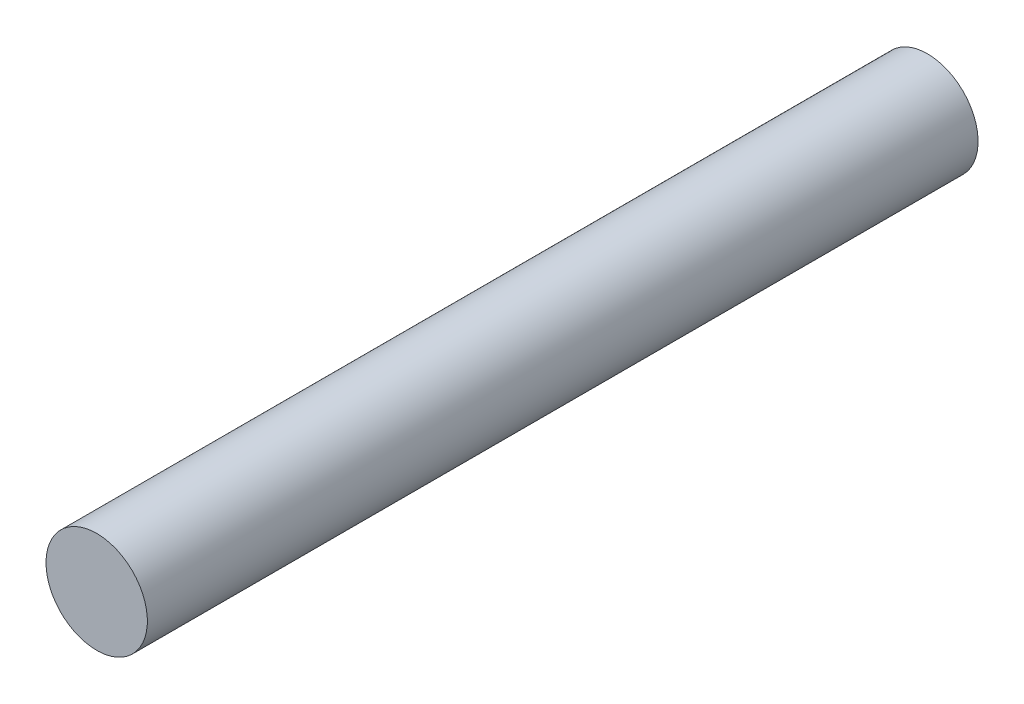
ISO-10303-21;
HEADER;
FILE_DESCRIPTION(('STEP AP214'),'2;1');
FILE_NAME('part.step','',(''),(''),'','','');
FILE_SCHEMA(('AUTOMOTIVE_DESIGN { 1 0 10303 214 1 1 1 1 }'));
ENDSEC;
DATA;
#1=APPLICATION_CONTEXT('core data for automotive mechanical design processes');
#2=APPLICATION_PROTOCOL_DEFINITION('international standard','automotive_design',2000,#1);
#3=PRODUCT_CONTEXT('',#1,'mechanical');
#4=PRODUCT('Part','Part','',(#3));
#5=PRODUCT_RELATED_PRODUCT_CATEGORY('part','',(#4));
#6=PRODUCT_DEFINITION_FORMATION('','',#4);
#7=PRODUCT_DEFINITION_CONTEXT('part definition',#1,'design');
#8=PRODUCT_DEFINITION('design','',#6,#7);
#9=PRODUCT_DEFINITION_SHAPE('','',#8);
#10=(LENGTH_UNIT() NAMED_UNIT(*) SI_UNIT(.MILLI.,.METRE.));
#11=(NAMED_UNIT(*) PLANE_ANGLE_UNIT() SI_UNIT($,.RADIAN.));
#12=(NAMED_UNIT(*) SI_UNIT($,.STERADIAN.) SOLID_ANGLE_UNIT());
#13=UNCERTAINTY_MEASURE_WITH_UNIT(LENGTH_MEASURE(1.E-05),#10,'distance_accuracy_value','');
#14=(GEOMETRIC_REPRESENTATION_CONTEXT(3) GLOBAL_UNCERTAINTY_ASSIGNED_CONTEXT((#13)) GLOBAL_UNIT_ASSIGNED_CONTEXT((#10,
#11,#12)) REPRESENTATION_CONTEXT('',''));
#15=CARTESIAN_POINT('',(0.,0.,0.));
#16=DIRECTION('',(0.,0.,1.));
#17=DIRECTION('',(1.,0.,0.));
#18=AXIS2_PLACEMENT_3D('',#15,#16,#17);
#19=CARTESIAN_POINT('',(0.,0.,0.));
#20=DIRECTION('',(0.,0.,1.));
#21=DIRECTION('',(1.,0.,0.));
#22=AXIS2_PLACEMENT_3D('',#19,#20,#21);
#23=PLANE('',#22);
#24=CARTESIAN_POINT('',(0.,0.,0.));
#25=DIRECTION('',(0.,0.,-1.));
#26=DIRECTION('',(-1.,0.,0.));
#27=AXIS2_PLACEMENT_3D('',#24,#25,#26);
#28=CIRCLE('',#27,0.52500022);
#29=CARTESIAN_POINT('',(-0.52500022,0.,0.));
#30=VERTEX_POINT('',#29);
#31=EDGE_CURVE('E18',#30,#30,#28,.F.);
#32=ORIENTED_EDGE('',*,*,#31,.F.);
#33=EDGE_LOOP('',(#32));
#34=FACE_BOUND('',#33,.T.);
#35=ADVANCED_FACE('F15',(#34),#23,.F.);
#36=CARTESIAN_POINT('',(0.,0.,8.6049993));
#37=DIRECTION('',(0.,0.,1.));
#38=DIRECTION('',(1.,0.,0.));
#39=AXIS2_PLACEMENT_3D('',#36,#37,#38);
#40=PLANE('',#39);
#41=CARTESIAN_POINT('',(0.,0.,8.6049993));
#42=DIRECTION('',(0.,0.,-1.));
#43=DIRECTION('',(-1.,0.,0.));
#44=AXIS2_PLACEMENT_3D('',#41,#42,#43);
#45=CIRCLE('',#44,0.52500022);
#46=CARTESIAN_POINT('',(-0.52500022,0.,8.6049993));
#47=VERTEX_POINT('',#46);
#48=EDGE_CURVE('E10',#47,#47,#45,.T.);
#49=ORIENTED_EDGE('',*,*,#48,.F.);
#50=EDGE_LOOP('',(#49));
#51=FACE_BOUND('',#50,.T.);
#52=ADVANCED_FACE('F30',(#51),#40,.T.);
#53=CARTESIAN_POINT('',(0.,0.,0.));
#54=DIRECTION('',(0.,0.,-1.));
#55=DIRECTION('',(-1.,0.,0.));
#56=AXIS2_PLACEMENT_3D('',#53,#54,#55);
#57=CYLINDRICAL_SURFACE('',#56,0.52500022);
#58=ORIENTED_EDGE('',*,*,#48,.T.);
#59=EDGE_LOOP('',(#58));
#60=FACE_BOUND('',#59,.T.);
#61=ORIENTED_EDGE('',*,*,#31,.T.);
#62=EDGE_LOOP('',(#61));
#63=FACE_BOUND('',#62,.T.);
#64=ADVANCED_FACE('F27',(#60,#63),#57,.T.);
#65=CLOSED_SHELL('',(#35,#52,#64));
#66=MANIFOLD_SOLID_BREP('B1',#65);
#67=ADVANCED_BREP_SHAPE_REPRESENTATION('',(#18,#66),#14);
#68=SHAPE_DEFINITION_REPRESENTATION(#9,#67);
ENDSEC;
END-ISO-10303-21;
